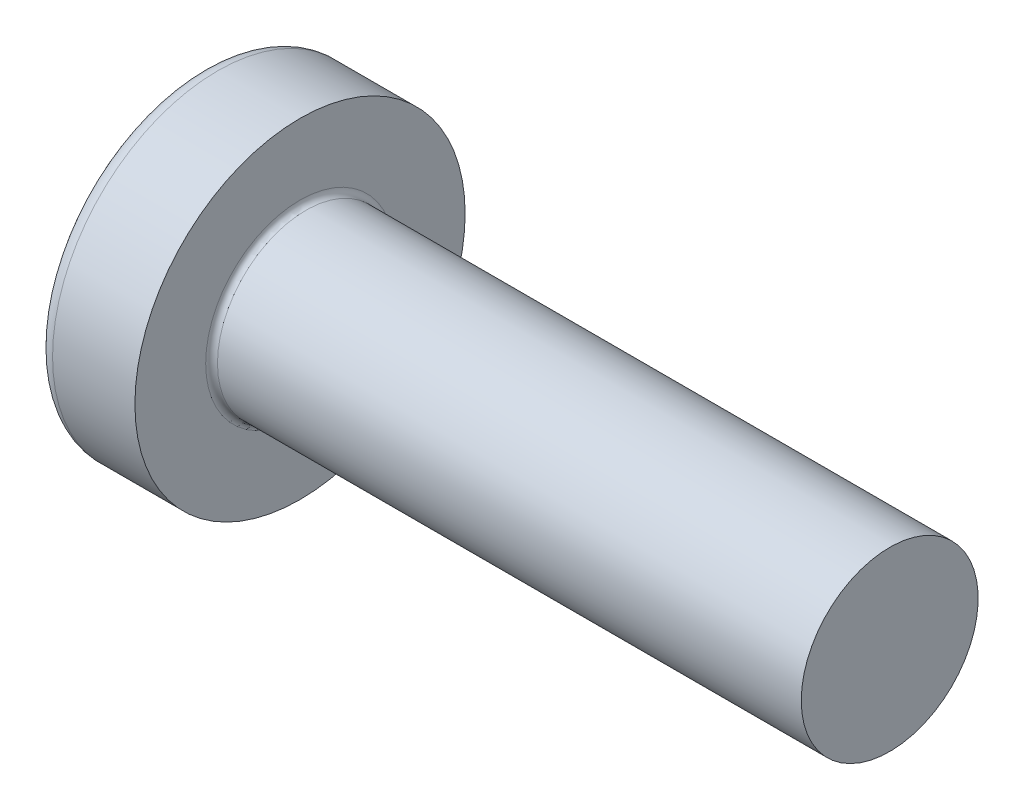
ISO-10303-21;
HEADER;
FILE_DESCRIPTION(('STEP AP214'),'2;1');
FILE_NAME('part.step','',(''),(''),'','','');
FILE_SCHEMA(('AUTOMOTIVE_DESIGN { 1 0 10303 214 1 1 1 1 }'));
ENDSEC;
DATA;
#1=APPLICATION_CONTEXT('core data for automotive mechanical design processes');
#2=APPLICATION_PROTOCOL_DEFINITION('international standard','automotive_design',2000,#1);
#3=PRODUCT_CONTEXT('',#1,'mechanical');
#4=PRODUCT('Part','Part','',(#3));
#5=PRODUCT_RELATED_PRODUCT_CATEGORY('part','',(#4));
#6=PRODUCT_DEFINITION_FORMATION('','',#4);
#7=PRODUCT_DEFINITION_CONTEXT('part definition',#1,'design');
#8=PRODUCT_DEFINITION('design','',#6,#7);
#9=PRODUCT_DEFINITION_SHAPE('','',#8);
#10=(LENGTH_UNIT() NAMED_UNIT(*) SI_UNIT(.MILLI.,.METRE.));
#11=(NAMED_UNIT(*) PLANE_ANGLE_UNIT() SI_UNIT($,.RADIAN.));
#12=(NAMED_UNIT(*) SI_UNIT($,.STERADIAN.) SOLID_ANGLE_UNIT());
#13=UNCERTAINTY_MEASURE_WITH_UNIT(LENGTH_MEASURE(1.E-05),#10,'distance_accuracy_value','');
#14=(GEOMETRIC_REPRESENTATION_CONTEXT(3) GLOBAL_UNCERTAINTY_ASSIGNED_CONTEXT((#13)) GLOBAL_UNIT_ASSIGNED_CONTEXT((#10,
#11,#12)) REPRESENTATION_CONTEXT('',''));
#15=CARTESIAN_POINT('',(0.,0.,0.));
#16=DIRECTION('',(0.,0.,1.));
#17=DIRECTION('',(1.,0.,0.));
#18=AXIS2_PLACEMENT_3D('',#15,#16,#17);
#19=CARTESIAN_POINT('',(5.,0.,0.));
#20=DIRECTION('',(-1.,0.,0.));
#21=DIRECTION('',(0.,1.,0.));
#22=AXIS2_PLACEMENT_3D('',#19,#20,#21);
#23=SPHERICAL_SURFACE('',#22,5.);
#24=CARTESIAN_POINT('',(0.775371598933733,0.,0.));
#25=DIRECTION('',(-1.,0.,0.));
#26=DIRECTION('',(0.,0.,1.));
#27=AXIS2_PLACEMENT_3D('',#24,#25,#26);
#28=CIRCLE('',#27,2.67441860465116);
#29=CARTESIAN_POINT('',(0.775371598933733,0.,2.67441860465116));
#30=VERTEX_POINT('',#29);
#31=EDGE_CURVE('E239',#30,#30,#28,.T.);
#32=ORIENTED_EDGE('',*,*,#31,.T.);
#33=EDGE_LOOP('',(#32));
#34=FACE_BOUND('',#33,.T.);
#35=CARTESIAN_POINT('',(0.0457951200896417,0.,0.));
#36=DIRECTION('',(1.,0.,0.));
#37=DIRECTION('',(0.,0.,-1.));
#38=AXIS2_PLACEMENT_3D('',#35,#36,#37);
#39=CIRCLE('',#38,0.675169614150692);
#40=CARTESIAN_POINT('',(0.0457951200896426,-0.369999999999998,-0.564760133040918));
#41=VERTEX_POINT('',#40);
#42=CARTESIAN_POINT('',(0.0457951200896417,-0.564760133040915,-0.37));
#43=VERTEX_POINT('',#42);
#44=EDGE_CURVE('E375',#41,#43,#39,.F.);
#45=ORIENTED_EDGE('',*,*,#44,.F.);
#46=CARTESIAN_POINT('',(5.,-0.37,0.));
#47=DIRECTION('',(0.,1.,0.));
#48=DIRECTION('',(0.,0.,1.));
#49=AXIS2_PLACEMENT_3D('',#46,#47,#48);
#50=CIRCLE('',#49,4.98629120689917);
#51=CARTESIAN_POINT('',(0.187869734228639,-0.369999999999995,-1.30633162146802));
#52=VERTEX_POINT('',#51);
#53=EDGE_CURVE('E301',#52,#41,#50,.T.);
#54=ORIENTED_EDGE('',*,*,#53,.F.);
#55=CARTESIAN_POINT('',(4.56358262530798,0.,0.875317983305919));
#56=DIRECTION('',(0.446197753347436,0.,-0.894934391398443));
#57=DIRECTION('',(-0.894934391398443,0.,-0.446197753347436));
#58=AXIS2_PLACEMENT_3D('',#55,#56,#57);
#59=CIRCLE('',#58,4.90340272700175);
#60=CARTESIAN_POINT('',(0.18786973422864,0.370000000000005,-1.30633162146802));
#61=VERTEX_POINT('',#60);
#62=EDGE_CURVE('E273',#52,#61,#59,.T.);
#63=ORIENTED_EDGE('',*,*,#62,.T.);
#64=CARTESIAN_POINT('',(5.,0.37,0.));
#65=DIRECTION('',(0.,-1.,0.));
#66=DIRECTION('',(0.,0.,-1.));
#67=AXIS2_PLACEMENT_3D('',#64,#65,#66);
#68=CIRCLE('',#67,4.98629120689917);
#69=CARTESIAN_POINT('',(0.0457951200896425,0.370000000000002,-0.564760133040916));
#70=VERTEX_POINT('',#69);
#71=EDGE_CURVE('E328',#70,#61,#68,.T.);
#72=ORIENTED_EDGE('',*,*,#71,.F.);
#73=CARTESIAN_POINT('',(0.0457951200896417,0.564760133040916,-0.37));
#74=VERTEX_POINT('',#73);
#75=EDGE_CURVE('E394',#74,#70,#39,.F.);
#76=ORIENTED_EDGE('',*,*,#75,.F.);
#77=CARTESIAN_POINT('',(5.,0.,-0.37));
#78=DIRECTION('',(0.,0.,1.));
#79=DIRECTION('',(1.,0.,0.));
#80=AXIS2_PLACEMENT_3D('',#77,#78,#79);
#81=CIRCLE('',#80,4.98629120689917);
#82=CARTESIAN_POINT('',(0.18786973422864,1.30633162146802,-0.37));
#83=VERTEX_POINT('',#82);
#84=EDGE_CURVE('E267',#83,#74,#81,.T.);
#85=ORIENTED_EDGE('',*,*,#84,.F.);
#86=CARTESIAN_POINT('',(4.56358262530798,-0.87531798330592,0.));
#87=DIRECTION('',(0.446197753347436,0.894934391398443,0.));
#88=DIRECTION('',(-0.894934391398442,0.446197753347436,0.));
#89=AXIS2_PLACEMENT_3D('',#86,#87,#88);
#90=CIRCLE('',#89,4.90340272700175);
#91=CARTESIAN_POINT('',(0.18786973422864,1.30633162146802,0.37));
#92=VERTEX_POINT('',#91);
#93=EDGE_CURVE('E270',#83,#92,#90,.T.);
#94=ORIENTED_EDGE('',*,*,#93,.T.);
#95=CARTESIAN_POINT('',(5.,0.,0.37));
#96=DIRECTION('',(0.,0.,-1.));
#97=DIRECTION('',(0.,1.,0.));
#98=AXIS2_PLACEMENT_3D('',#95,#96,#97);
#99=CIRCLE('',#98,4.98629120689917);
#100=CARTESIAN_POINT('',(0.0457951200896417,0.564760133040916,0.37));
#101=VERTEX_POINT('',#100);
#102=EDGE_CURVE('E263',#101,#92,#99,.T.);
#103=ORIENTED_EDGE('',*,*,#102,.F.);
#104=CARTESIAN_POINT('',(0.0457951200896434,0.369999999999998,0.564760133040918));
#105=VERTEX_POINT('',#104);
#106=EDGE_CURVE('E393',#105,#101,#39,.F.);
#107=ORIENTED_EDGE('',*,*,#106,.F.);
#108=CARTESIAN_POINT('',(0.18786973422864,0.369999999999995,1.30633162146802));
#109=VERTEX_POINT('',#108);
#110=EDGE_CURVE('E283',#109,#105,#68,.T.);
#111=ORIENTED_EDGE('',*,*,#110,.F.);
#112=CARTESIAN_POINT('',(4.56358262530798,0.,-0.87531798330592));
#113=DIRECTION('',(0.446197753347436,0.,0.894934391398443));
#114=DIRECTION('',(0.894934391398442,0.,-0.446197753347436));
#115=AXIS2_PLACEMENT_3D('',#112,#113,#114);
#116=CIRCLE('',#115,4.90340272700175);
#117=CARTESIAN_POINT('',(0.18786973422864,-0.370000000000005,1.30633162146802));
#118=VERTEX_POINT('',#117);
#119=EDGE_CURVE('E50',#109,#118,#116,.T.);
#120=ORIENTED_EDGE('',*,*,#119,.T.);
#121=CARTESIAN_POINT('',(0.0457951200896421,-0.370000000000002,0.564760133040916));
#122=VERTEX_POINT('',#121);
#123=EDGE_CURVE('E280',#122,#118,#50,.T.);
#124=ORIENTED_EDGE('',*,*,#123,.F.);
#125=CARTESIAN_POINT('',(0.0457951200896417,-0.564760133040916,0.37));
#126=VERTEX_POINT('',#125);
#127=EDGE_CURVE('E433',#126,#122,#39,.F.);
#128=ORIENTED_EDGE('',*,*,#127,.F.);
#129=CARTESIAN_POINT('',(0.187869734228639,-1.30633162146802,0.37));
#130=VERTEX_POINT('',#129);
#131=EDGE_CURVE('E264',#130,#126,#99,.T.);
#132=ORIENTED_EDGE('',*,*,#131,.F.);
#133=CARTESIAN_POINT('',(4.56358262530798,0.875317983305919,0.));
#134=DIRECTION('',(0.446197753347436,-0.894934391398443,0.));
#135=DIRECTION('',(0.894934391398443,0.446197753347436,0.));
#136=AXIS2_PLACEMENT_3D('',#133,#134,#135);
#137=CIRCLE('',#136,4.90340272700175);
#138=CARTESIAN_POINT('',(0.18786973422864,-1.30633162146802,-0.37));
#139=VERTEX_POINT('',#138);
#140=EDGE_CURVE('E260',#130,#139,#137,.T.);
#141=ORIENTED_EDGE('',*,*,#140,.T.);
#142=EDGE_CURVE('E65',#43,#139,#81,.T.);
#143=ORIENTED_EDGE('',*,*,#142,.F.);
#144=EDGE_LOOP('',(#45,#54,#63,#72,#76,#85,#94,#103,#107,#111,#120,#124,#128,#132,#141,#143));
#145=FACE_BOUND('',#144,.T.);
#146=ADVANCED_FACE('F36',(#34,#145),#23,.T.);
#147=CARTESIAN_POINT('',(1.75,0.527482331818931,-0.37));
#148=DIRECTION('',(0.,0.,1.));
#149=DIRECTION('',(1.,0.,0.));
#150=AXIS2_PLACEMENT_3D('',#147,#148,#149);
#151=PLANE('',#150);
#152=ORIENTED_EDGE('',*,*,#84,.T.);
#153=CARTESIAN_POINT('',(-0.987293237053716,0.649401255967161,-0.37));
#154=CARTESIAN_POINT('',(-0.781914975317084,0.632865887002871,-0.37));
#155=CARTESIAN_POINT('',(-0.576547882393372,0.616188977635081,-0.37));
#156=CARTESIAN_POINT('',(-0.165841599226327,0.582441031964227,-0.37));
#157=CARTESIAN_POINT('',(0.0394975903090452,0.56536998705488,-0.37));
#158=CARTESIAN_POINT('',(0.450133475422572,0.530723441326535,-0.37));
#159=CARTESIAN_POINT('',(0.655430171010573,0.513147940624557,-0.37));
#160=CARTESIAN_POINT('',(1.06596140177934,0.477314957985794,-0.37));
#161=CARTESIAN_POINT('',(1.2711959378071,0.459057485806066,-0.37));
#162=CARTESIAN_POINT('',(1.61065292365626,0.428051938688768,-0.37));
#163=CARTESIAN_POINT('',(1.74490059995643,0.415580824990931,-0.37));
#164=CARTESIAN_POINT('',(2.01334321762763,0.390092023404979,-0.37));
#165=CARTESIAN_POINT('',(2.14753815934577,0.377074339177353,-0.37));
#166=CARTESIAN_POINT('',(2.41586354151957,0.350315629452843,-0.37));
#167=CARTESIAN_POINT('',(2.5499939784531,0.33657456817765,-0.37));
#168=CARTESIAN_POINT('',(2.81814173295471,0.308004077741875,-0.37));
#169=CARTESIAN_POINT('',(2.95215904765134,0.293174621747065,-0.37));
#170=CARTESIAN_POINT('',(3.0860955068368,0.277618485071816,-0.37));
#171=B_SPLINE_CURVE_WITH_KNOTS('',3,(#153,#154,#155,#156,#157,#158,#159,#160,#161,#162,#163,
#164,#165,#166,#167,#168,#169,#170),.UNSPECIFIED.,.F.,.F.,(4,2,2,2,2,2,2,2,4),(0.,
0.618128793984691,1.23627109812525,1.85441325887562,2.4725465791681,2.87702276218609,
3.28149623678161,3.68598973550942,4.09049321032311),.UNSPECIFIED.);
#172=CARTESIAN_POINT('',(1.75,0.415013252800437,-0.37));
#173=VERTEX_POINT('',#172);
#174=EDGE_CURVE('E417',#74,#173,#171,.T.);
#175=ORIENTED_EDGE('',*,*,#174,.T.);
#176=DIRECTION('',(0.,1.,0.));
#177=VECTOR('',#176,1.);
#178=CARTESIAN_POINT('',(1.75,-0.527482331818931,-0.37));
#179=LINE('',#178,#177);
#180=CARTESIAN_POINT('',(1.75,0.527482331818931,-0.37));
#181=VERTEX_POINT('',#180);
#182=EDGE_CURVE('E357',#173,#181,#179,.T.);
#183=ORIENTED_EDGE('',*,*,#182,.T.);
#184=DIRECTION('',(0.894934391398442,-0.446197753347436,0.));
#185=VECTOR('',#184,1.);
#186=CARTESIAN_POINT('',(0.,1.4,-0.37));
#187=LINE('',#186,#185);
#188=EDGE_CURVE('E240',#83,#181,#187,.T.);
#189=ORIENTED_EDGE('',*,*,#188,.F.);
#190=EDGE_LOOP('',(#152,#175,#183,#189));
#191=FACE_BOUND('',#190,.T.);
#192=ADVANCED_FACE('F195',(#191),#151,.T.);
#193=CARTESIAN_POINT('',(1.75,-0.527482331818931,-0.37));
#194=VERTEX_POINT('',#193);
#195=CARTESIAN_POINT('',(1.75,-0.415013252800437,-0.37));
#196=VERTEX_POINT('',#195);
#197=EDGE_CURVE('E248',#194,#196,#179,.T.);
#198=ORIENTED_EDGE('',*,*,#197,.T.);
#199=CARTESIAN_POINT('',(-0.987293237053716,-0.649401255967161,-0.37));
#200=CARTESIAN_POINT('',(-0.781914975317084,-0.632865887002871,-0.37));
#201=CARTESIAN_POINT('',(-0.576547882393372,-0.616188977635081,-0.37));
#202=CARTESIAN_POINT('',(-0.165841599226327,-0.582441031964227,-0.37));
#203=CARTESIAN_POINT('',(0.0394975903090452,-0.56536998705488,-0.37));
#204=CARTESIAN_POINT('',(0.450133475422572,-0.530723441326535,-0.37));
#205=CARTESIAN_POINT('',(0.655430171010573,-0.513147940624557,-0.37));
#206=CARTESIAN_POINT('',(1.06596140177934,-0.477314957985794,-0.37));
#207=CARTESIAN_POINT('',(1.2711959378071,-0.459057485806066,-0.37));
#208=CARTESIAN_POINT('',(1.61065292365626,-0.428051938688768,-0.37));
#209=CARTESIAN_POINT('',(1.74490059995643,-0.415580824990931,-0.37));
#210=CARTESIAN_POINT('',(2.01334321762763,-0.390092023404979,-0.37));
#211=CARTESIAN_POINT('',(2.14753815934577,-0.377074339177353,-0.37));
#212=CARTESIAN_POINT('',(2.41586354151957,-0.350315629452843,-0.37));
#213=CARTESIAN_POINT('',(2.5499939784531,-0.33657456817765,-0.37));
#214=CARTESIAN_POINT('',(2.81814173295471,-0.308004077741875,-0.37));
#215=CARTESIAN_POINT('',(2.95215904765134,-0.293174621747065,-0.37));
#216=CARTESIAN_POINT('',(3.0860955068368,-0.277618485071816,-0.37));
#217=B_SPLINE_CURVE_WITH_KNOTS('',3,(#199,#200,#201,#202,#203,#204,#205,#206,#207,#208,#209,
#210,#211,#212,#213,#214,#215,#216),.UNSPECIFIED.,.F.,.F.,(4,2,2,2,2,2,2,2,4),(0.,
0.618128793984691,1.23627109812525,1.85441325887562,2.4725465791681,2.87702276218609,
3.28149623678161,3.68598973550942,4.09049321032311),.UNSPECIFIED.);
#218=EDGE_CURVE('E392',#196,#43,#217,.F.);
#219=ORIENTED_EDGE('',*,*,#218,.T.);
#220=ORIENTED_EDGE('',*,*,#142,.T.);
#221=DIRECTION('',(0.894934391398442,0.446197753347436,0.));
#222=VECTOR('',#221,1.);
#223=CARTESIAN_POINT('',(0.,-1.4,-0.37));
#224=LINE('',#223,#222);
#225=EDGE_CURVE('E331',#139,#194,#224,.T.);
#226=ORIENTED_EDGE('',*,*,#225,.T.);
#227=EDGE_LOOP('',(#198,#219,#220,#226));
#228=FACE_BOUND('',#227,.T.);
#229=ADVANCED_FACE('F201',(#228),#151,.T.);
#230=CARTESIAN_POINT('',(1.75,-0.527482331818931,0.37));
#231=DIRECTION('',(0.,0.,-1.));
#232=DIRECTION('',(0.,1.,0.));
#233=AXIS2_PLACEMENT_3D('',#230,#231,#232);
#234=PLANE('',#233);
#235=DIRECTION('',(0.,-1.,0.));
#236=VECTOR('',#235,1.);
#237=CARTESIAN_POINT('',(1.75,0.527482331818931,0.37));
#238=LINE('',#237,#236);
#239=CARTESIAN_POINT('',(1.75,0.527482331818931,0.37));
#240=VERTEX_POINT('',#239);
#241=CARTESIAN_POINT('',(1.75,0.415013252800437,0.37));
#242=VERTEX_POINT('',#241);
#243=EDGE_CURVE('E340',#240,#242,#238,.T.);
#244=ORIENTED_EDGE('',*,*,#243,.T.);
#245=CARTESIAN_POINT('',(-0.987293237069635,0.649401255968442,0.37));
#246=CARTESIAN_POINT('',(-0.781914975331301,0.632865887004023,0.37));
#247=CARTESIAN_POINT('',(-0.576547882405888,0.616188977636102,0.37));
#248=CARTESIAN_POINT('',(-0.16584159923544,0.582441031964983,0.37));
#249=CARTESIAN_POINT('',(0.0394975903016338,0.5653699870555,0.37));
#250=CARTESIAN_POINT('',(0.450133475420601,0.530723441326706,0.37));
#251=CARTESIAN_POINT('',(0.655430171012341,0.513147940624409,0.37));
#252=CARTESIAN_POINT('',(1.06596140178858,0.477314957984981,0.37));
#253=CARTESIAN_POINT('',(1.27119593782008,0.459057485804908,0.37));
#254=CARTESIAN_POINT('',(1.61065292367297,0.428051938687225,0.37));
#255=CARTESIAN_POINT('',(1.74490059997313,0.415580824989367,0.37));
#256=CARTESIAN_POINT('',(2.01334321764434,0.39009202340337,0.37));
#257=CARTESIAN_POINT('',(2.14753815936247,0.377074339175718,0.37));
#258=CARTESIAN_POINT('',(2.41586354153627,0.350315629451146,0.37));
#259=CARTESIAN_POINT('',(2.54999397846979,0.336574568175918,0.37));
#260=CARTESIAN_POINT('',(2.8181417329714,0.308004077740054,0.37));
#261=CARTESIAN_POINT('',(2.95215904766802,0.29317462174519,0.37));
#262=CARTESIAN_POINT('',(3.08609550685347,0.277618485069873,0.37));
#263=B_SPLINE_CURVE_WITH_KNOTS('',3,(#245,#246,#247,#248,#249,#250,#251,#252,#253,#254,#255,
#256,#257,#258,#259,#260,#261,#262),.UNSPECIFIED.,.F.,.F.,(4,2,2,2,2,2,2,2,4),(0.,
0.61812879398981,1.23627109813549,1.85441325889711,2.47254657920086,2.87702276221884,
3.28149623681436,3.68598973554218,4.09049321035586),.UNSPECIFIED.);
#264=EDGE_CURVE('E672',#242,#101,#263,.F.);
#265=ORIENTED_EDGE('',*,*,#264,.T.);
#266=ORIENTED_EDGE('',*,*,#102,.T.);
#267=DIRECTION('',(0.894934391398442,-0.446197753347436,0.));
#268=VECTOR('',#267,1.);
#269=CARTESIAN_POINT('',(0.,1.4,0.37));
#270=LINE('',#269,#268);
#271=EDGE_CURVE('E245',#92,#240,#270,.T.);
#272=ORIENTED_EDGE('',*,*,#271,.T.);
#273=EDGE_LOOP('',(#244,#265,#266,#272));
#274=FACE_BOUND('',#273,.T.);
#275=ADVANCED_FACE('F413',(#274),#234,.T.);
#276=ORIENTED_EDGE('',*,*,#131,.T.);
#277=CARTESIAN_POINT('',(-0.987293237069635,-0.649401255968442,0.37));
#278=CARTESIAN_POINT('',(-0.781914975331301,-0.632865887004023,0.37));
#279=CARTESIAN_POINT('',(-0.576547882405888,-0.616188977636102,0.37));
#280=CARTESIAN_POINT('',(-0.16584159923544,-0.582441031964983,0.37));
#281=CARTESIAN_POINT('',(0.0394975903016338,-0.5653699870555,0.37));
#282=CARTESIAN_POINT('',(0.450133475420601,-0.530723441326706,0.37));
#283=CARTESIAN_POINT('',(0.655430171012341,-0.513147940624409,0.37));
#284=CARTESIAN_POINT('',(1.06596140178858,-0.477314957984981,0.37));
#285=CARTESIAN_POINT('',(1.27119593782008,-0.459057485804908,0.37));
#286=CARTESIAN_POINT('',(1.61065292367297,-0.428051938687225,0.37));
#287=CARTESIAN_POINT('',(1.74490059997313,-0.415580824989367,0.37));
#288=CARTESIAN_POINT('',(2.01334321764434,-0.390092023403371,0.37));
#289=CARTESIAN_POINT('',(2.14753815936247,-0.377074339175718,0.37));
#290=CARTESIAN_POINT('',(2.41586354153627,-0.350315629451146,0.37));
#291=CARTESIAN_POINT('',(2.54999397846979,-0.336574568175918,0.37));
#292=CARTESIAN_POINT('',(2.8181417329714,-0.308004077740054,0.37));
#293=CARTESIAN_POINT('',(2.95215904766802,-0.29317462174519,0.37));
#294=CARTESIAN_POINT('',(3.08609550685347,-0.277618485069873,0.37));
#295=B_SPLINE_CURVE_WITH_KNOTS('',3,(#277,#278,#279,#280,#281,#282,#283,#284,#285,#286,#287,
#288,#289,#290,#291,#292,#293,#294),.UNSPECIFIED.,.F.,.F.,(4,2,2,2,2,2,2,2,4),(0.,
0.61812879398981,1.23627109813549,1.85441325889711,2.47254657920086,2.87702276221884,
3.28149623681436,3.68598973554218,4.09049321035586),.UNSPECIFIED.);
#296=CARTESIAN_POINT('',(1.75,-0.415013252800437,0.37));
#297=VERTEX_POINT('',#296);
#298=EDGE_CURVE('E434',#126,#297,#295,.T.);
#299=ORIENTED_EDGE('',*,*,#298,.T.);
#300=CARTESIAN_POINT('',(1.75,-0.527482331818932,0.37));
#301=VERTEX_POINT('',#300);
#302=EDGE_CURVE('E342',#297,#301,#238,.T.);
#303=ORIENTED_EDGE('',*,*,#302,.T.);
#304=DIRECTION('',(0.894934391398443,0.446197753347436,0.));
#305=VECTOR('',#304,1.);
#306=CARTESIAN_POINT('',(0.,-1.4,0.37));
#307=LINE('',#306,#305);
#308=EDGE_CURVE('E333',#130,#301,#307,.T.);
#309=ORIENTED_EDGE('',*,*,#308,.F.);
#310=EDGE_LOOP('',(#276,#299,#303,#309));
#311=FACE_BOUND('',#310,.T.);
#312=ADVANCED_FACE('F520',(#311),#234,.T.);
#313=CARTESIAN_POINT('',(1.75,0.527482331818931,0.37));
#314=DIRECTION('',(0.446197753347436,0.894934391398443,0.));
#315=DIRECTION('',(-0.894934391398442,0.446197753347436,0.));
#316=AXIS2_PLACEMENT_3D('',#313,#314,#315);
#317=PLANE('',#316);
#318=CARTESIAN_POINT('',(2.6696526882832,0.0689604923233249,0.));
#319=DIRECTION('',(0.446197753347436,0.894934391398443,0.));
#320=DIRECTION('',(-0.894934391398443,0.446197753347436,0.));
#321=AXIS2_PLACEMENT_3D('',#318,#319,#320);
#322=ELLIPSE('',#321,1.10195897609154,0.486831694838766);
#323=CARTESIAN_POINT('',(1.75,0.527482331818932,0.175779377683682));
#324=VERTEX_POINT('',#323);
#325=CARTESIAN_POINT('',(1.75,0.527482331818932,-0.175779377683682));
#326=VERTEX_POINT('',#325);
#327=EDGE_CURVE('E306',#324,#326,#322,.F.);
#328=ORIENTED_EDGE('',*,*,#327,.F.);
#329=DIRECTION('',(0.,0.,-1.));
#330=VECTOR('',#329,1.);
#331=CARTESIAN_POINT('',(1.75,0.527482331818931,0.37));
#332=LINE('',#331,#330);
#333=EDGE_CURVE('E343',#240,#324,#332,.T.);
#334=ORIENTED_EDGE('',*,*,#333,.F.);
#335=ORIENTED_EDGE('',*,*,#271,.F.);
#336=ORIENTED_EDGE('',*,*,#93,.F.);
#337=ORIENTED_EDGE('',*,*,#188,.T.);
#338=EDGE_CURVE('E345',#326,#181,#332,.T.);
#339=ORIENTED_EDGE('',*,*,#338,.F.);
#340=EDGE_LOOP('',(#328,#334,#335,#336,#337,#339));
#341=FACE_BOUND('',#340,.T.);
#342=ADVANCED_FACE('F411',(#341),#317,.F.);
#343=CARTESIAN_POINT('',(0.,-1.4,-0.37));
#344=DIRECTION('',(0.446197753347436,-0.894934391398443,0.));
#345=DIRECTION('',(0.894934391398443,0.446197753347436,0.));
#346=AXIS2_PLACEMENT_3D('',#343,#344,#345);
#347=PLANE('',#346);
#348=CARTESIAN_POINT('',(2.6696526882832,-0.0689604923233252,0.));
#349=DIRECTION('',(0.446197753347436,-0.894934391398443,0.));
#350=DIRECTION('',(-0.894934391398443,-0.446197753347436,0.));
#351=AXIS2_PLACEMENT_3D('',#348,#349,#350);
#352=ELLIPSE('',#351,1.10195897609154,0.486831694838766);
#353=CARTESIAN_POINT('',(1.75,-0.527482331818932,-0.175779377683681));
#354=VERTEX_POINT('',#353);
#355=CARTESIAN_POINT('',(1.75,-0.527482331818932,0.175779377683681));
#356=VERTEX_POINT('',#355);
#357=EDGE_CURVE('E674',#354,#356,#352,.F.);
#358=ORIENTED_EDGE('',*,*,#357,.F.);
#359=DIRECTION('',(0.,0.,1.));
#360=VECTOR('',#359,1.);
#361=CARTESIAN_POINT('',(1.75,-0.527482331818931,-0.37));
#362=LINE('',#361,#360);
#363=EDGE_CURVE('E336',#194,#354,#362,.T.);
#364=ORIENTED_EDGE('',*,*,#363,.F.);
#365=ORIENTED_EDGE('',*,*,#225,.F.);
#366=ORIENTED_EDGE('',*,*,#140,.F.);
#367=ORIENTED_EDGE('',*,*,#308,.T.);
#368=EDGE_CURVE('E339',#356,#301,#362,.T.);
#369=ORIENTED_EDGE('',*,*,#368,.F.);
#370=EDGE_LOOP('',(#358,#364,#365,#366,#367,#369));
#371=FACE_BOUND('',#370,.T.);
#372=ADVANCED_FACE('F507',(#371),#347,.F.);
#373=CARTESIAN_POINT('',(1.75,0.527482331818931,-0.37));
#374=DIRECTION('',(-1.,0.,0.));
#375=DIRECTION('',(0.,0.,1.));
#376=AXIS2_PLACEMENT_3D('',#373,#374,#375);
#377=PLANE('',#376);
#378=DIRECTION('',(0.,1.,0.));
#379=VECTOR('',#378,1.);
#380=CARTESIAN_POINT('',(1.75,-0.370000000000002,0.52748233181893));
#381=LINE('',#380,#379);
#382=CARTESIAN_POINT('',(1.75,-0.370000000000002,0.52748233181893));
#383=VERTEX_POINT('',#382);
#384=CARTESIAN_POINT('',(1.75,-0.175779377683686,0.52748233181893));
#385=VERTEX_POINT('',#384);
#386=EDGE_CURVE('E321',#383,#385,#381,.T.);
#387=ORIENTED_EDGE('',*,*,#386,.T.);
#388=CARTESIAN_POINT('',(1.75,0.,0.));
#389=DIRECTION('',(-1.,0.,0.));
#390=DIRECTION('',(0.,0.,1.));
#391=AXIS2_PLACEMENT_3D('',#388,#389,#390);
#392=CIRCLE('',#391,0.556);
#393=CARTESIAN_POINT('',(1.75,-0.370000000000001,0.415013252800436));
#394=VERTEX_POINT('',#393);
#395=EDGE_CURVE('E702',#394,#385,#392,.T.);
#396=ORIENTED_EDGE('',*,*,#395,.F.);
#397=DIRECTION('',(0.,0.,-1.));
#398=VECTOR('',#397,1.);
#399=CARTESIAN_POINT('',(1.75,-0.370000000000002,0.52748233181893));
#400=LINE('',#399,#398);
#401=EDGE_CURVE('E317',#383,#394,#400,.T.);
#402=ORIENTED_EDGE('',*,*,#401,.F.);
#403=EDGE_LOOP('',(#387,#396,#402));
#404=FACE_BOUND('',#403,.T.);
#405=ADVANCED_FACE('F500',(#404),#377,.T.);
#406=ORIENTED_EDGE('',*,*,#302,.F.);
#407=EDGE_CURVE('E707',#356,#297,#392,.T.);
#408=ORIENTED_EDGE('',*,*,#407,.F.);
#409=ORIENTED_EDGE('',*,*,#368,.T.);
#410=EDGE_LOOP('',(#406,#408,#409));
#411=FACE_BOUND('',#410,.T.);
#412=ADVANCED_FACE('F493',(#411),#377,.T.);
#413=ORIENTED_EDGE('',*,*,#363,.T.);
#414=EDGE_CURVE('E386',#196,#354,#392,.T.);
#415=ORIENTED_EDGE('',*,*,#414,.F.);
#416=ORIENTED_EDGE('',*,*,#197,.F.);
#417=EDGE_LOOP('',(#413,#415,#416));
#418=FACE_BOUND('',#417,.T.);
#419=ADVANCED_FACE('F487',(#418),#377,.T.);
#420=CARTESIAN_POINT('',(1.75,-0.369999999999998,-0.415013252800438));
#421=VERTEX_POINT('',#420);
#422=CARTESIAN_POINT('',(1.75,-0.369999999999998,-0.527482331818933));
#423=VERTEX_POINT('',#422);
#424=EDGE_CURVE('E320',#421,#423,#400,.T.);
#425=ORIENTED_EDGE('',*,*,#424,.F.);
#426=CARTESIAN_POINT('',(1.75,-0.17577937768368,-0.527482331818932));
#427=VERTEX_POINT('',#426);
#428=EDGE_CURVE('E57',#427,#421,#392,.T.);
#429=ORIENTED_EDGE('',*,*,#428,.F.);
#430=DIRECTION('',(0.,-1.,0.));
#431=VECTOR('',#430,1.);
#432=CARTESIAN_POINT('',(1.75,0.370000000000002,-0.52748233181893));
#433=LINE('',#432,#431);
#434=EDGE_CURVE('E316',#427,#423,#433,.T.);
#435=ORIENTED_EDGE('',*,*,#434,.T.);
#436=EDGE_LOOP('',(#425,#429,#435));
#437=FACE_BOUND('',#436,.T.);
#438=ADVANCED_FACE('F381',(#437),#377,.T.);
#439=CARTESIAN_POINT('',(1.75,0.370000000000002,-0.52748233181893));
#440=VERTEX_POINT('',#439);
#441=CARTESIAN_POINT('',(1.75,0.175779377683684,-0.527482331818931));
#442=VERTEX_POINT('',#441);
#443=EDGE_CURVE('E313',#440,#442,#433,.T.);
#444=ORIENTED_EDGE('',*,*,#443,.T.);
#445=CARTESIAN_POINT('',(1.75,0.370000000000001,-0.415013252800436));
#446=VERTEX_POINT('',#445);
#447=EDGE_CURVE('E385',#446,#442,#392,.T.);
#448=ORIENTED_EDGE('',*,*,#447,.F.);
#449=DIRECTION('',(0.,0.,1.));
#450=VECTOR('',#449,1.);
#451=CARTESIAN_POINT('',(1.75,0.370000000000002,-0.52748233181893));
#452=LINE('',#451,#450);
#453=EDGE_CURVE('E325',#440,#446,#452,.T.);
#454=ORIENTED_EDGE('',*,*,#453,.F.);
#455=EDGE_LOOP('',(#444,#448,#454));
#456=FACE_BOUND('',#455,.T.);
#457=ADVANCED_FACE('F475',(#456),#377,.T.);
#458=ORIENTED_EDGE('',*,*,#182,.F.);
#459=EDGE_CURVE('E691',#326,#173,#392,.T.);
#460=ORIENTED_EDGE('',*,*,#459,.F.);
#461=ORIENTED_EDGE('',*,*,#338,.T.);
#462=EDGE_LOOP('',(#458,#460,#461));
#463=FACE_BOUND('',#462,.T.);
#464=ADVANCED_FACE('F468',(#463),#377,.T.);
#465=ORIENTED_EDGE('',*,*,#333,.T.);
#466=EDGE_CURVE('E693',#242,#324,#392,.T.);
#467=ORIENTED_EDGE('',*,*,#466,.F.);
#468=ORIENTED_EDGE('',*,*,#243,.F.);
#469=EDGE_LOOP('',(#465,#467,#468));
#470=FACE_BOUND('',#469,.T.);
#471=ADVANCED_FACE('F462',(#470),#377,.T.);
#472=CARTESIAN_POINT('',(1.75,0.369999999999998,0.527482331818932));
#473=DIRECTION('',(0.,-1.,0.));
#474=DIRECTION('',(1.,0.,0.));
#475=AXIS2_PLACEMENT_3D('',#472,#473,#474);
#476=PLANE('',#475);
#477=ORIENTED_EDGE('',*,*,#110,.T.);
#478=CARTESIAN_POINT('',(-0.987293237069635,0.369999999999998,0.649401255968443));
#479=CARTESIAN_POINT('',(-0.781914975331301,0.369999999999998,0.632865887004024));
#480=CARTESIAN_POINT('',(-0.576547882405888,0.369999999999998,0.616188977636103));
#481=CARTESIAN_POINT('',(-0.16584159923544,0.369999999999998,0.582441031964984));
#482=CARTESIAN_POINT('',(0.0394975903016338,0.369999999999998,0.565369987055501));
#483=CARTESIAN_POINT('',(0.450133475420601,0.369999999999998,0.530723441326707));
#484=CARTESIAN_POINT('',(0.655430171012341,0.369999999999998,0.51314794062441));
#485=CARTESIAN_POINT('',(1.06596140178858,0.369999999999998,0.477314957984982));
#486=CARTESIAN_POINT('',(1.27119593782008,0.369999999999998,0.459057485804909));
#487=CARTESIAN_POINT('',(1.61065292367297,0.369999999999999,0.428051938687226));
#488=CARTESIAN_POINT('',(1.74490059997313,0.369999999999999,0.415580824989369));
#489=CARTESIAN_POINT('',(2.01334321764434,0.369999999999999,0.390092023403372));
#490=CARTESIAN_POINT('',(2.14753815936247,0.369999999999999,0.37707433917572));
#491=CARTESIAN_POINT('',(2.41586354153627,0.369999999999999,0.350315629451147));
#492=CARTESIAN_POINT('',(2.54999397846979,0.369999999999999,0.336574568175919));
#493=CARTESIAN_POINT('',(2.8181417329714,0.369999999999999,0.308004077740055));
#494=CARTESIAN_POINT('',(2.95215904766802,0.369999999999999,0.293174621745191));
#495=CARTESIAN_POINT('',(3.08609550685347,0.369999999999999,0.277618485069875));
#496=B_SPLINE_CURVE_WITH_KNOTS('',3,(#478,#479,#480,#481,#482,#483,#484,#485,#486,#487,#488,
#489,#490,#491,#492,#493,#494,#495),.UNSPECIFIED.,.F.,.F.,(4,2,2,2,2,2,2,2,4),(0.,
0.61812879398981,1.23627109813549,1.85441325889711,2.47254657920086,2.87702276221884,
3.28149623681436,3.68598973554218,4.09049321035586),.UNSPECIFIED.);
#497=CARTESIAN_POINT('',(1.75,0.369999999999999,0.415013252800439));
#498=VERTEX_POINT('',#497);
#499=EDGE_CURVE('E671',#105,#498,#496,.T.);
#500=ORIENTED_EDGE('',*,*,#499,.T.);
#501=CARTESIAN_POINT('',(1.75,0.369999999999998,0.527482331818932));
#502=VERTEX_POINT('',#501);
#503=EDGE_CURVE('E298',#498,#502,#452,.T.);
#504=ORIENTED_EDGE('',*,*,#503,.T.);
#505=DIRECTION('',(0.894934391398442,0.,-0.446197753347436));
#506=VECTOR('',#505,1.);
#507=CARTESIAN_POINT('',(0.,0.369999999999995,1.4));
#508=LINE('',#507,#506);
#509=EDGE_CURVE('E291',#109,#502,#508,.T.);
#510=ORIENTED_EDGE('',*,*,#509,.F.);
#511=EDGE_LOOP('',(#477,#500,#504,#510));
#512=FACE_BOUND('',#511,.T.);
#513=ADVANCED_FACE('F295',(#512),#476,.T.);
#514=CARTESIAN_POINT('',(1.75,-0.369999999999998,-0.527482331818933));
#515=DIRECTION('',(0.,1.,0.));
#516=DIRECTION('',(0.,0.,1.));
#517=AXIS2_PLACEMENT_3D('',#514,#515,#516);
#518=PLANE('',#517);
#519=ORIENTED_EDGE('',*,*,#401,.T.);
#520=CARTESIAN_POINT('',(-0.987293237053716,-0.370000000000002,0.649401255967159));
#521=CARTESIAN_POINT('',(-0.781914975317084,-0.370000000000002,0.63286588700287));
#522=CARTESIAN_POINT('',(-0.576547882393372,-0.370000000000002,0.616188977635079));
#523=CARTESIAN_POINT('',(-0.165841599226327,-0.370000000000002,0.582441031964225));
#524=CARTESIAN_POINT('',(0.039497590309045,-0.370000000000002,0.565369987054878));
#525=CARTESIAN_POINT('',(0.450133475422572,-0.370000000000002,0.530723441326534));
#526=CARTESIAN_POINT('',(0.655430171010573,-0.370000000000002,0.513147940624556));
#527=CARTESIAN_POINT('',(1.06596140177934,-0.370000000000002,0.477314957985792));
#528=CARTESIAN_POINT('',(1.2711959378071,-0.370000000000002,0.459057485806065));
#529=CARTESIAN_POINT('',(1.61065292365626,-0.370000000000001,0.428051938688767));
#530=CARTESIAN_POINT('',(1.74490059995642,-0.370000000000001,0.41558082499093));
#531=CARTESIAN_POINT('',(2.01334321762763,-0.370000000000001,0.390092023404978));
#532=CARTESIAN_POINT('',(2.14753815934577,-0.370000000000001,0.377074339177352));
#533=CARTESIAN_POINT('',(2.41586354151957,-0.370000000000001,0.350315629452841));
#534=CARTESIAN_POINT('',(2.5499939784531,-0.370000000000001,0.336574568177649));
#535=CARTESIAN_POINT('',(2.81814173295471,-0.370000000000001,0.308004077741874));
#536=CARTESIAN_POINT('',(2.95215904765134,-0.370000000000001,0.293174621747064));
#537=CARTESIAN_POINT('',(3.0860955068368,-0.370000000000001,0.277618485071814));
#538=B_SPLINE_CURVE_WITH_KNOTS('',3,(#520,#521,#522,#523,#524,#525,#526,#527,#528,#529,#530,
#531,#532,#533,#534,#535,#536,#537),.UNSPECIFIED.,.F.,.F.,(4,2,2,2,2,2,2,2,4),(0.,
0.618128793984691,1.23627109812525,1.85441325887562,2.4725465791681,2.87702276218609,
3.28149623678161,3.68598973550942,4.09049321032311),.UNSPECIFIED.);
#539=EDGE_CURVE('E426',#394,#122,#538,.F.);
#540=ORIENTED_EDGE('',*,*,#539,.T.);
#541=ORIENTED_EDGE('',*,*,#123,.T.);
#542=DIRECTION('',(0.894934391398442,0.,-0.446197753347436));
#543=VECTOR('',#542,1.);
#544=CARTESIAN_POINT('',(0.,-0.370000000000005,1.4));
#545=LINE('',#544,#543);
#546=EDGE_CURVE('E293',#118,#383,#545,.T.);
#547=ORIENTED_EDGE('',*,*,#546,.T.);
#548=EDGE_LOOP('',(#519,#540,#541,#547));
#549=FACE_BOUND('',#548,.T.);
#550=ADVANCED_FACE('F230',(#549),#518,.T.);
#551=CARTESIAN_POINT('',(1.75,-0.370000000000002,0.52748233181893));
#552=DIRECTION('',(0.446197753347436,0.,0.894934391398443));
#553=DIRECTION('',(-0.894934391398442,0.,0.446197753347436));
#554=AXIS2_PLACEMENT_3D('',#551,#552,#553);
#555=PLANE('',#554);
#556=CARTESIAN_POINT('',(2.6696526882832,0.,0.0689604923233248));
#557=DIRECTION('',(0.446197753347436,0.,0.894934391398443));
#558=DIRECTION('',(-0.894934391398443,0.,0.446197753347436));
#559=AXIS2_PLACEMENT_3D('',#556,#557,#558);
#560=ELLIPSE('',#559,1.10195897609154,0.486831694838766);
#561=CARTESIAN_POINT('',(1.75,0.175779377683682,0.527482331818932));
#562=VERTEX_POINT('',#561);
#563=EDGE_CURVE('E424',#385,#562,#560,.F.);
#564=ORIENTED_EDGE('',*,*,#563,.F.);
#565=ORIENTED_EDGE('',*,*,#386,.F.);
#566=ORIENTED_EDGE('',*,*,#546,.F.);
#567=ORIENTED_EDGE('',*,*,#119,.F.);
#568=ORIENTED_EDGE('',*,*,#509,.T.);
#569=EDGE_CURVE('E324',#562,#502,#381,.T.);
#570=ORIENTED_EDGE('',*,*,#569,.F.);
#571=EDGE_LOOP('',(#564,#565,#566,#567,#568,#570));
#572=FACE_BOUND('',#571,.T.);
#573=ADVANCED_FACE('F289',(#572),#555,.F.);
#574=CARTESIAN_POINT('',(0.,0.370000000000005,-1.4));
#575=DIRECTION('',(0.446197753347436,0.,-0.894934391398443));
#576=DIRECTION('',(0.894934391398443,0.,0.446197753347436));
#577=AXIS2_PLACEMENT_3D('',#574,#575,#576);
#578=PLANE('',#577);
#579=CARTESIAN_POINT('',(2.6696526882832,0.,-0.0689604923233253));
#580=DIRECTION('',(0.446197753347436,0.,-0.894934391398443));
#581=DIRECTION('',(-0.894934391398443,0.,-0.446197753347436));
#582=AXIS2_PLACEMENT_3D('',#579,#580,#581);
#583=ELLIPSE('',#582,1.10195897609154,0.486831694838766);
#584=EDGE_CURVE('E379',#442,#427,#583,.F.);
#585=ORIENTED_EDGE('',*,*,#584,.F.);
#586=ORIENTED_EDGE('',*,*,#443,.F.);
#587=DIRECTION('',(0.894934391398442,0.,0.446197753347436));
#588=VECTOR('',#587,1.);
#589=CARTESIAN_POINT('',(0.,0.370000000000005,-1.4));
#590=LINE('',#589,#588);
#591=EDGE_CURVE('E303',#61,#440,#590,.T.);
#592=ORIENTED_EDGE('',*,*,#591,.F.);
#593=ORIENTED_EDGE('',*,*,#62,.F.);
#594=DIRECTION('',(0.894934391398443,0.,0.446197753347436));
#595=VECTOR('',#594,1.);
#596=CARTESIAN_POINT('',(0.,-0.369999999999995,-1.4));
#597=LINE('',#596,#595);
#598=EDGE_CURVE('E310',#52,#423,#597,.T.);
#599=ORIENTED_EDGE('',*,*,#598,.T.);
#600=ORIENTED_EDGE('',*,*,#434,.F.);
#601=EDGE_LOOP('',(#585,#586,#592,#593,#599,#600));
#602=FACE_BOUND('',#601,.T.);
#603=ADVANCED_FACE('F370',(#602),#578,.F.);
#604=ORIENTED_EDGE('',*,*,#453,.T.);
#605=CARTESIAN_POINT('',(-0.987293237053716,0.370000000000002,-0.649401255967159));
#606=CARTESIAN_POINT('',(-0.781914975317084,0.370000000000002,-0.63286588700287));
#607=CARTESIAN_POINT('',(-0.576547882393372,0.370000000000002,-0.61618897763508));
#608=CARTESIAN_POINT('',(-0.165841599226327,0.370000000000002,-0.582441031964225));
#609=CARTESIAN_POINT('',(0.039497590309045,0.370000000000002,-0.565369987054878));
#610=CARTESIAN_POINT('',(0.450133475422572,0.370000000000002,-0.530723441326533));
#611=CARTESIAN_POINT('',(0.655430171010573,0.370000000000002,-0.513147940624555));
#612=CARTESIAN_POINT('',(1.06596140177934,0.370000000000002,-0.477314957985793));
#613=CARTESIAN_POINT('',(1.2711959378071,0.370000000000002,-0.459057485806065));
#614=CARTESIAN_POINT('',(1.61065292365626,0.370000000000001,-0.428051938688767));
#615=CARTESIAN_POINT('',(1.74490059995642,0.370000000000001,-0.41558082499093));
#616=CARTESIAN_POINT('',(2.01334321762763,0.370000000000001,-0.390092023404978));
#617=CARTESIAN_POINT('',(2.14753815934577,0.370000000000001,-0.377074339177352));
#618=CARTESIAN_POINT('',(2.41586354151957,0.370000000000001,-0.350315629452841));
#619=CARTESIAN_POINT('',(2.5499939784531,0.370000000000001,-0.336574568177649));
#620=CARTESIAN_POINT('',(2.81814173295471,0.370000000000001,-0.308004077741874));
#621=CARTESIAN_POINT('',(2.95215904765134,0.370000000000001,-0.293174621747064));
#622=CARTESIAN_POINT('',(3.0860955068368,0.370000000000001,-0.277618485071814));
#623=B_SPLINE_CURVE_WITH_KNOTS('',3,(#605,#606,#607,#608,#609,#610,#611,#612,#613,#614,#615,
#616,#617,#618,#619,#620,#621,#622),.UNSPECIFIED.,.F.,.F.,(4,2,2,2,2,2,2,2,4),(0.,
0.618128793984691,1.23627109812525,1.85441325887562,2.4725465791681,2.87702276218609,
3.28149623678161,3.68598973550942,4.09049321032311),.UNSPECIFIED.);
#624=EDGE_CURVE('E366',#446,#70,#623,.F.);
#625=ORIENTED_EDGE('',*,*,#624,.T.);
#626=ORIENTED_EDGE('',*,*,#71,.T.);
#627=ORIENTED_EDGE('',*,*,#591,.T.);
#628=EDGE_LOOP('',(#604,#625,#626,#627));
#629=FACE_BOUND('',#628,.T.);
#630=ADVANCED_FACE('F228',(#629),#476,.T.);
#631=ORIENTED_EDGE('',*,*,#53,.T.);
#632=CARTESIAN_POINT('',(-0.987293237053716,-0.369999999999998,-0.649401255967162));
#633=CARTESIAN_POINT('',(-0.781914975317084,-0.369999999999998,-0.632865887002873));
#634=CARTESIAN_POINT('',(-0.576547882393372,-0.369999999999998,-0.616188977635082));
#635=CARTESIAN_POINT('',(-0.165841599226327,-0.369999999999998,-0.582441031964228));
#636=CARTESIAN_POINT('',(0.0394975903090453,-0.369999999999998,-0.565369987054881));
#637=CARTESIAN_POINT('',(0.450133475422572,-0.369999999999998,-0.530723441326536));
#638=CARTESIAN_POINT('',(0.655430171010573,-0.369999999999998,-0.513147940624558));
#639=CARTESIAN_POINT('',(1.06596140177934,-0.369999999999998,-0.477314957985795));
#640=CARTESIAN_POINT('',(1.2711959378071,-0.369999999999998,-0.459057485806067));
#641=CARTESIAN_POINT('',(1.61065292365626,-0.369999999999998,-0.42805193868877));
#642=CARTESIAN_POINT('',(1.74490059995643,-0.369999999999998,-0.415580824990932));
#643=CARTESIAN_POINT('',(2.01334321762763,-0.369999999999999,-0.390092023404981));
#644=CARTESIAN_POINT('',(2.14753815934577,-0.369999999999999,-0.377074339177355));
#645=CARTESIAN_POINT('',(2.41586354151957,-0.369999999999999,-0.350315629452844));
#646=CARTESIAN_POINT('',(2.5499939784531,-0.369999999999999,-0.336574568177652));
#647=CARTESIAN_POINT('',(2.81814173295471,-0.369999999999999,-0.308004077741877));
#648=CARTESIAN_POINT('',(2.95215904765134,-0.369999999999999,-0.293174621747066));
#649=CARTESIAN_POINT('',(3.0860955068368,-0.369999999999999,-0.277618485071817));
#650=B_SPLINE_CURVE_WITH_KNOTS('',3,(#632,#633,#634,#635,#636,#637,#638,#639,#640,#641,#642,
#643,#644,#645,#646,#647,#648,#649),.UNSPECIFIED.,.F.,.F.,(4,2,2,2,2,2,2,2,4),(0.,
0.618128793984691,1.23627109812525,1.85441325887562,2.4725465791681,2.87702276218609,
3.28149623678161,3.68598973550942,4.09049321032311),.UNSPECIFIED.);
#651=EDGE_CURVE('E11',#41,#421,#650,.T.);
#652=ORIENTED_EDGE('',*,*,#651,.T.);
#653=ORIENTED_EDGE('',*,*,#424,.T.);
#654=ORIENTED_EDGE('',*,*,#598,.F.);
#655=EDGE_LOOP('',(#631,#652,#653,#654));
#656=FACE_BOUND('',#655,.T.);
#657=ADVANCED_FACE('F223',(#656),#518,.T.);
#658=CARTESIAN_POINT('',(-25.4,0.,0.));
#659=DIRECTION('',(-1.,0.,0.));
#660=DIRECTION('',(0.,0.,1.));
#661=AXIS2_PLACEMENT_3D('',#658,#659,#660);
#662=CYLINDRICAL_SURFACE('',#661,1.5);
#663=CARTESIAN_POINT('',(2.5,0.,0.));
#664=DIRECTION('',(-1.,0.,0.));
#665=DIRECTION('',(0.,0.,1.));
#666=AXIS2_PLACEMENT_3D('',#663,#664,#665);
#667=CIRCLE('',#666,1.5);
#668=CARTESIAN_POINT('',(2.5,0.,1.5));
#669=VERTEX_POINT('',#668);
#670=EDGE_CURVE('E234',#669,#669,#667,.F.);
#671=ORIENTED_EDGE('',*,*,#670,.T.);
#672=EDGE_LOOP('',(#671));
#673=FACE_BOUND('',#672,.T.);
#674=CARTESIAN_POINT('',(12.4,0.,0.));
#675=DIRECTION('',(-1.,0.,0.));
#676=DIRECTION('',(0.,0.,1.));
#677=AXIS2_PLACEMENT_3D('',#674,#675,#676);
#678=CIRCLE('',#677,1.5);
#679=CARTESIAN_POINT('',(12.4,0.,1.5));
#680=VERTEX_POINT('',#679);
#681=EDGE_CURVE('E237',#680,#680,#678,.T.);
#682=ORIENTED_EDGE('',*,*,#681,.T.);
#683=EDGE_LOOP('',(#682));
#684=FACE_BOUND('',#683,.T.);
#685=ADVANCED_FACE('F220',(#673,#684),#662,.T.);
#686=CARTESIAN_POINT('',(2.4,1.5,0.));
#687=DIRECTION('',(-1.,0.,0.));
#688=DIRECTION('',(0.,0.,1.));
#689=AXIS2_PLACEMENT_3D('',#686,#687,#688);
#690=PLANE('',#689);
#691=CARTESIAN_POINT('',(2.4,0.,0.));
#692=DIRECTION('',(-1.,0.,0.));
#693=DIRECTION('',(0.,0.,1.));
#694=AXIS2_PLACEMENT_3D('',#691,#692,#693);
#695=CIRCLE('',#694,1.6);
#696=CARTESIAN_POINT('',(2.4,0.,1.6));
#697=VERTEX_POINT('',#696);
#698=EDGE_CURVE('E256',#697,#697,#695,.T.);
#699=ORIENTED_EDGE('',*,*,#698,.T.);
#700=EDGE_LOOP('',(#699));
#701=FACE_BOUND('',#700,.T.);
#702=CARTESIAN_POINT('',(2.4,0.,0.));
#703=DIRECTION('',(-1.,0.,0.));
#704=DIRECTION('',(0.,0.,1.));
#705=AXIS2_PLACEMENT_3D('',#702,#703,#704);
#706=CIRCLE('',#705,2.8);
#707=CARTESIAN_POINT('',(2.4,0.,2.8));
#708=VERTEX_POINT('',#707);
#709=EDGE_CURVE('E253',#708,#708,#706,.T.);
#710=ORIENTED_EDGE('',*,*,#709,.F.);
#711=EDGE_LOOP('',(#710));
#712=FACE_BOUND('',#711,.T.);
#713=ADVANCED_FACE('F217',(#701,#712),#690,.F.);
#714=CARTESIAN_POINT('',(-25.4,0.,0.));
#715=DIRECTION('',(-1.,0.,0.));
#716=DIRECTION('',(0.,0.,1.));
#717=AXIS2_PLACEMENT_3D('',#714,#715,#716);
#718=CYLINDRICAL_SURFACE('',#717,2.8);
#719=ORIENTED_EDGE('',*,*,#709,.T.);
#720=EDGE_LOOP('',(#719));
#721=FACE_BOUND('',#720,.T.);
#722=CARTESIAN_POINT('',(1.00350153259131,0.,0.));
#723=DIRECTION('',(-1.,0.,0.));
#724=DIRECTION('',(0.,0.,1.));
#725=AXIS2_PLACEMENT_3D('',#722,#723,#724);
#726=CIRCLE('',#725,2.8);
#727=CARTESIAN_POINT('',(1.00350153259131,0.,2.8));
#728=VERTEX_POINT('',#727);
#729=EDGE_CURVE('E242',#728,#728,#726,.T.);
#730=ORIENTED_EDGE('',*,*,#729,.F.);
#731=EDGE_LOOP('',(#730));
#732=FACE_BOUND('',#731,.T.);
#733=ADVANCED_FACE('F213',(#721,#732),#718,.T.);
#734=CARTESIAN_POINT('',(1.00350153259131,0.,0.));
#735=DIRECTION('',(-1.,0.,0.));
#736=DIRECTION('',(0.,0.,1.));
#737=AXIS2_PLACEMENT_3D('',#734,#735,#736);
#738=TOROIDAL_SURFACE('',#737,2.53,0.27);
#739=ORIENTED_EDGE('',*,*,#729,.T.);
#740=EDGE_LOOP('',(#739));
#741=FACE_BOUND('',#740,.T.);
#742=ORIENTED_EDGE('',*,*,#31,.F.);
#743=EDGE_LOOP('',(#742));
#744=FACE_BOUND('',#743,.T.);
#745=ADVANCED_FACE('F210',(#741,#744),#738,.T.);
#746=CARTESIAN_POINT('',(12.4,1.5,0.));
#747=DIRECTION('',(1.,0.,0.));
#748=DIRECTION('',(0.,0.,-1.));
#749=AXIS2_PLACEMENT_3D('',#746,#747,#748);
#750=PLANE('',#749);
#751=ORIENTED_EDGE('',*,*,#681,.F.);
#752=EDGE_LOOP('',(#751));
#753=FACE_BOUND('',#752,.T.);
#754=ADVANCED_FACE('F208',(#753),#750,.T.);
#755=CARTESIAN_POINT('',(2.5,0.,0.));
#756=DIRECTION('',(-1.,0.,0.));
#757=DIRECTION('',(0.,0.,1.));
#758=AXIS2_PLACEMENT_3D('',#755,#756,#757);
#759=TOROIDAL_SURFACE('',#758,1.6,0.1);
#760=ORIENTED_EDGE('',*,*,#670,.F.);
#761=EDGE_LOOP('',(#760));
#762=FACE_BOUND('',#761,.T.);
#763=ORIENTED_EDGE('',*,*,#698,.F.);
#764=EDGE_LOOP('',(#763));
#765=FACE_BOUND('',#764,.T.);
#766=ADVANCED_FACE('F38',(#762,#765),#759,.F.);
#767=ORIENTED_EDGE('',*,*,#503,.F.);
#768=EDGE_CURVE('E387',#562,#498,#392,.T.);
#769=ORIENTED_EDGE('',*,*,#768,.F.);
#770=ORIENTED_EDGE('',*,*,#569,.T.);
#771=EDGE_LOOP('',(#767,#769,#770));
#772=FACE_BOUND('',#771,.T.);
#773=ADVANCED_FACE('F469',(#772),#377,.T.);
#774=CARTESIAN_POINT('',(1.75,0.,0.));
#775=DIRECTION('',(-1.,0.,0.));
#776=DIRECTION('',(0.,0.,1.));
#777=AXIS2_PLACEMENT_3D('',#774,#775,#776);
#778=CONICAL_SURFACE('',#777,0.556,0.0698131700797659);
#779=ORIENTED_EDGE('',*,*,#327,.T.);
#780=EDGE_CURVE('E688',#324,#326,#392,.T.);
#781=ORIENTED_EDGE('',*,*,#780,.F.);
#782=EDGE_LOOP('',(#779,#781));
#783=FACE_BOUND('',#782,.T.);
#784=ADVANCED_FACE('F192',(#783),#778,.F.);
#785=ORIENTED_EDGE('',*,*,#357,.T.);
#786=EDGE_CURVE('E708',#354,#356,#392,.T.);
#787=ORIENTED_EDGE('',*,*,#786,.F.);
#788=EDGE_LOOP('',(#785,#787));
#789=FACE_BOUND('',#788,.T.);
#790=ADVANCED_FACE('F602',(#789),#778,.F.);
#791=EDGE_CURVE('E389',#498,#242,#392,.T.);
#792=ORIENTED_EDGE('',*,*,#791,.F.);
#793=ORIENTED_EDGE('',*,*,#499,.F.);
#794=ORIENTED_EDGE('',*,*,#106,.T.);
#795=ORIENTED_EDGE('',*,*,#264,.F.);
#796=EDGE_LOOP('',(#792,#793,#794,#795));
#797=FACE_BOUND('',#796,.T.);
#798=ADVANCED_FACE('F608',(#797),#778,.F.);
#799=ORIENTED_EDGE('',*,*,#563,.T.);
#800=EDGE_CURVE('E390',#385,#562,#392,.T.);
#801=ORIENTED_EDGE('',*,*,#800,.F.);
#802=EDGE_LOOP('',(#799,#801));
#803=FACE_BOUND('',#802,.T.);
#804=ADVANCED_FACE('F615',(#803),#778,.F.);
#805=ORIENTED_EDGE('',*,*,#584,.T.);
#806=EDGE_CURVE('E382',#442,#427,#392,.T.);
#807=ORIENTED_EDGE('',*,*,#806,.F.);
#808=EDGE_LOOP('',(#805,#807));
#809=FACE_BOUND('',#808,.T.);
#810=ADVANCED_FACE('F622',(#809),#778,.F.);
#811=ORIENTED_EDGE('',*,*,#127,.T.);
#812=ORIENTED_EDGE('',*,*,#539,.F.);
#813=EDGE_CURVE('E704',#297,#394,#392,.T.);
#814=ORIENTED_EDGE('',*,*,#813,.F.);
#815=ORIENTED_EDGE('',*,*,#298,.F.);
#816=EDGE_LOOP('',(#811,#812,#814,#815));
#817=FACE_BOUND('',#816,.T.);
#818=ADVANCED_FACE('F629',(#817),#778,.F.);
#819=ORIENTED_EDGE('',*,*,#75,.T.);
#820=ORIENTED_EDGE('',*,*,#624,.F.);
#821=EDGE_CURVE('E694',#173,#446,#392,.T.);
#822=ORIENTED_EDGE('',*,*,#821,.F.);
#823=ORIENTED_EDGE('',*,*,#174,.F.);
#824=EDGE_LOOP('',(#819,#820,#822,#823));
#825=FACE_BOUND('',#824,.T.);
#826=ADVANCED_FACE('F190',(#825),#778,.F.);
#827=EDGE_CURVE('E383',#421,#196,#392,.T.);
#828=ORIENTED_EDGE('',*,*,#827,.F.);
#829=ORIENTED_EDGE('',*,*,#651,.F.);
#830=ORIENTED_EDGE('',*,*,#44,.T.);
#831=ORIENTED_EDGE('',*,*,#218,.F.);
#832=EDGE_LOOP('',(#828,#829,#830,#831));
#833=FACE_BOUND('',#832,.T.);
#834=ADVANCED_FACE('F185',(#833),#778,.F.);
#835=CARTESIAN_POINT('',(1.93065535110549,0.,0.));
#836=DIRECTION('',(-1.,0.,0.));
#837=DIRECTION('',(0.,0.,1.));
#838=AXIS2_PLACEMENT_3D('',#835,#836,#837);
#839=CONICAL_SURFACE('',#838,0.,1.25663706143592);
#840=ORIENTED_EDGE('',*,*,#768,.T.);
#841=ORIENTED_EDGE('',*,*,#791,.T.);
#842=ORIENTED_EDGE('',*,*,#466,.T.);
#843=ORIENTED_EDGE('',*,*,#780,.T.);
#844=ORIENTED_EDGE('',*,*,#459,.T.);
#845=ORIENTED_EDGE('',*,*,#821,.T.);
#846=ORIENTED_EDGE('',*,*,#447,.T.);
#847=ORIENTED_EDGE('',*,*,#806,.T.);
#848=ORIENTED_EDGE('',*,*,#428,.T.);
#849=ORIENTED_EDGE('',*,*,#827,.T.);
#850=ORIENTED_EDGE('',*,*,#414,.T.);
#851=ORIENTED_EDGE('',*,*,#786,.T.);
#852=ORIENTED_EDGE('',*,*,#407,.T.);
#853=ORIENTED_EDGE('',*,*,#813,.T.);
#854=ORIENTED_EDGE('',*,*,#395,.T.);
#855=ORIENTED_EDGE('',*,*,#800,.T.);
#856=EDGE_LOOP('',(#840,#841,#842,#843,#844,#845,#846,#847,#848,#849,#850,#851,#852,#853,#854,#855));
#857=FACE_BOUND('',#856,.T.);
#858=CARTESIAN_POINT('',(1.93065535110549,0.,0.));
#859=VERTEX_POINT('',#858);
#860=VERTEX_LOOP('',#859);
#861=FACE_BOUND('',#860,.T.);
#862=ADVANCED_FACE('F183',(#857,#861),#839,.F.);
#863=CLOSED_SHELL('',(#146,#192,#229,#275,#312,#342,#372,#405,#412,#419,#438,#457,#464,#471,
#513,#550,#573,#603,#630,#657,#685,#713,#733,#745,#754,#766,#773,#784,#790,#798,#804,#810,#818,
#826,#834,#862));
#864=MANIFOLD_SOLID_BREP('B2',#863);
#865=ADVANCED_BREP_SHAPE_REPRESENTATION('',(#18,#864),#14);
#866=SHAPE_DEFINITION_REPRESENTATION(#9,#865);
ENDSEC;
END-ISO-10303-21;
